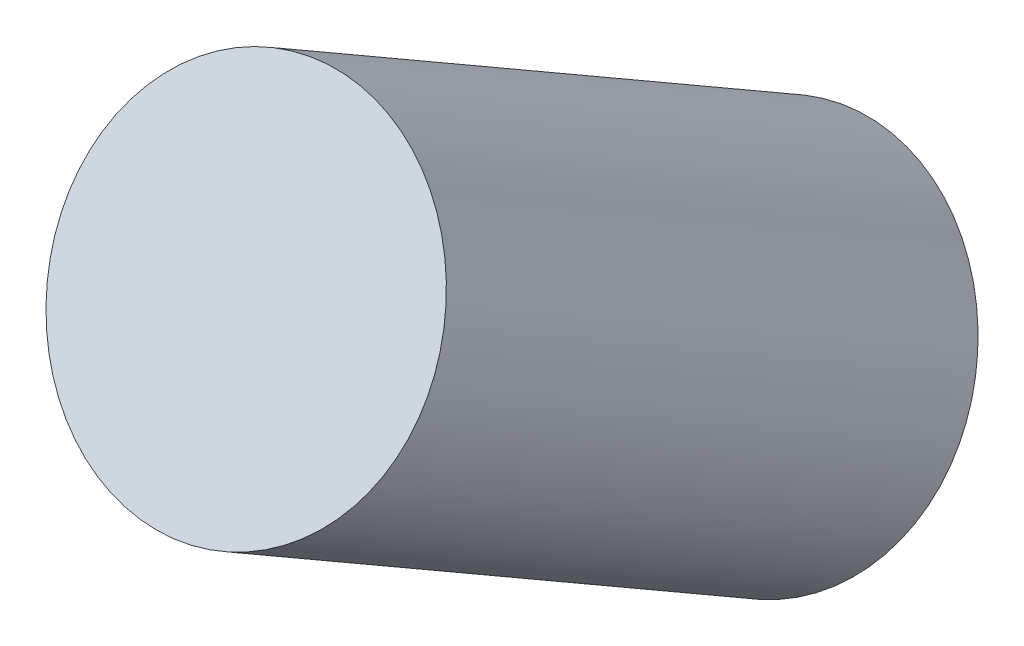
ISO-10303-21;
HEADER;
FILE_DESCRIPTION(('STEP AP214'),'2;1');
FILE_NAME('part.step','',(''),(''),'','','');
FILE_SCHEMA(('AUTOMOTIVE_DESIGN { 1 0 10303 214 1 1 1 1 }'));
ENDSEC;
DATA;
#1=APPLICATION_CONTEXT('core data for automotive mechanical design processes');
#2=APPLICATION_PROTOCOL_DEFINITION('international standard','automotive_design',2000,#1);
#3=PRODUCT_CONTEXT('',#1,'mechanical');
#4=PRODUCT('Part','Part','',(#3));
#5=PRODUCT_RELATED_PRODUCT_CATEGORY('part','',(#4));
#6=PRODUCT_DEFINITION_FORMATION('','',#4);
#7=PRODUCT_DEFINITION_CONTEXT('part definition',#1,'design');
#8=PRODUCT_DEFINITION('design','',#6,#7);
#9=PRODUCT_DEFINITION_SHAPE('','',#8);
#10=(LENGTH_UNIT() NAMED_UNIT(*) SI_UNIT(.MILLI.,.METRE.));
#11=(NAMED_UNIT(*) PLANE_ANGLE_UNIT() SI_UNIT($,.RADIAN.));
#12=(NAMED_UNIT(*) SI_UNIT($,.STERADIAN.) SOLID_ANGLE_UNIT());
#13=UNCERTAINTY_MEASURE_WITH_UNIT(LENGTH_MEASURE(1.E-05),#10,'distance_accuracy_value','');
#14=(GEOMETRIC_REPRESENTATION_CONTEXT(3) GLOBAL_UNCERTAINTY_ASSIGNED_CONTEXT((#13)) GLOBAL_UNIT_ASSIGNED_CONTEXT((#10,
#11,#12)) REPRESENTATION_CONTEXT('',''));
#15=CARTESIAN_POINT('',(0.,0.,0.));
#16=DIRECTION('',(0.,0.,1.));
#17=DIRECTION('',(1.,0.,0.));
#18=AXIS2_PLACEMENT_3D('',#15,#16,#17);
#19=CARTESIAN_POINT('',(93.,23.5934393919997,28.5304445662277));
#20=DIRECTION('',(0.,0.5,0.866025403784439));
#21=DIRECTION('',(0.,-0.866025403784439,0.5));
#22=AXIS2_PLACEMENT_3D('',#19,#20,#21);
#23=PLANE('',#22);
#24=CARTESIAN_POINT('',(93.,23.5934393919997,28.5304445662277));
#25=DIRECTION('',(0.,0.5,0.866025403784439));
#26=DIRECTION('',(0.,-0.866025403784439,0.5));
#27=AXIS2_PLACEMENT_3D('',#24,#25,#26);
#28=CIRCLE('',#27,1.75000000000001);
#29=CARTESIAN_POINT('',(93.,22.0778949353769,29.4054445662277));
#30=VERTEX_POINT('',#29);
#31=EDGE_CURVE('E18',#30,#30,#28,.F.);
#32=ORIENTED_EDGE('',*,*,#31,.F.);
#33=EDGE_LOOP('',(#32));
#34=FACE_BOUND('',#33,.T.);
#35=ADVANCED_FACE('F15',(#34),#23,.T.);
#36=CARTESIAN_POINT('',(92.9999999999999,20.322806453317,23.4905421435211));
#37=DIRECTION('',(0.,0.5,0.866025403784439));
#38=DIRECTION('',(0.,-0.866025403784439,0.5));
#39=AXIS2_PLACEMENT_3D('',#36,#37,#38);
#40=PLANE('',#39);
#41=CARTESIAN_POINT('',(93.,20.5934393919997,23.334292143521));
#42=DIRECTION('',(0.,0.5,0.866025403784439));
#43=DIRECTION('',(0.,-0.866025403784439,0.5));
#44=AXIS2_PLACEMENT_3D('',#41,#42,#43);
#45=CIRCLE('',#44,1.75000000000001);
#46=CARTESIAN_POINT('',(93.,19.0778949353769,24.209292143521));
#47=VERTEX_POINT('',#46);
#48=EDGE_CURVE('E10',#47,#47,#45,.T.);
#49=ORIENTED_EDGE('',*,*,#48,.F.);
#50=EDGE_LOOP('',(#49));
#51=FACE_BOUND('',#50,.T.);
#52=ADVANCED_FACE('F30',(#51),#40,.F.);
#53=CARTESIAN_POINT('',(93.,18.5934393919997,19.8701905283833));
#54=DIRECTION('',(0.,0.5,0.866025403784439));
#55=DIRECTION('',(0.,-0.866025403784439,0.5));
#56=AXIS2_PLACEMENT_3D('',#53,#54,#55);
#57=CYLINDRICAL_SURFACE('',#56,1.75000000000001);
#58=ORIENTED_EDGE('',*,*,#48,.T.);
#59=EDGE_LOOP('',(#58));
#60=FACE_BOUND('',#59,.T.);
#61=ORIENTED_EDGE('',*,*,#31,.T.);
#62=EDGE_LOOP('',(#61));
#63=FACE_BOUND('',#62,.T.);
#64=ADVANCED_FACE('F27',(#60,#63),#57,.T.);
#65=CLOSED_SHELL('',(#35,#52,#64));
#66=MANIFOLD_SOLID_BREP('B1',#65);
#67=ADVANCED_BREP_SHAPE_REPRESENTATION('',(#18,#66),#14);
#68=SHAPE_DEFINITION_REPRESENTATION(#9,#67);
ENDSEC;
END-ISO-10303-21;
